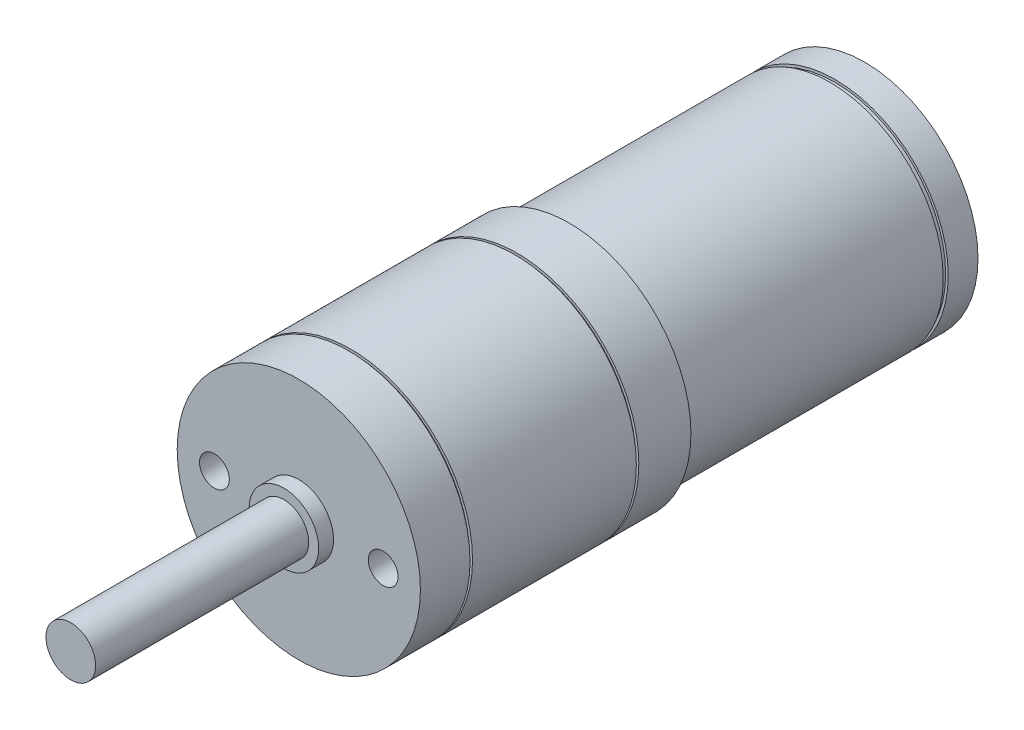
ISO-10303-21;
HEADER;
FILE_DESCRIPTION(('STEP AP214'),'2;1');
FILE_NAME('part.step','',(''),(''),'','','');
FILE_SCHEMA(('AUTOMOTIVE_DESIGN { 1 0 10303 214 1 1 1 1 }'));
ENDSEC;
DATA;
#1=APPLICATION_CONTEXT('core data for automotive mechanical design processes');
#2=APPLICATION_PROTOCOL_DEFINITION('international standard','automotive_design',2000,#1);
#3=PRODUCT_CONTEXT('',#1,'mechanical');
#4=PRODUCT('Part','Part','',(#3));
#5=PRODUCT_RELATED_PRODUCT_CATEGORY('part','',(#4));
#6=PRODUCT_DEFINITION_FORMATION('','',#4);
#7=PRODUCT_DEFINITION_CONTEXT('part definition',#1,'design');
#8=PRODUCT_DEFINITION('design','',#6,#7);
#9=PRODUCT_DEFINITION_SHAPE('','',#8);
#10=(LENGTH_UNIT() NAMED_UNIT(*) SI_UNIT(.MILLI.,.METRE.));
#11=(NAMED_UNIT(*) PLANE_ANGLE_UNIT() SI_UNIT($,.RADIAN.));
#12=(NAMED_UNIT(*) SI_UNIT($,.STERADIAN.) SOLID_ANGLE_UNIT());
#13=UNCERTAINTY_MEASURE_WITH_UNIT(LENGTH_MEASURE(1.E-05),#10,'distance_accuracy_value','');
#14=(GEOMETRIC_REPRESENTATION_CONTEXT(3) GLOBAL_UNCERTAINTY_ASSIGNED_CONTEXT((#13)) GLOBAL_UNIT_ASSIGNED_CONTEXT((#10,
#11,#12)) REPRESENTATION_CONTEXT('',''));
#15=CARTESIAN_POINT('',(0.,0.,0.));
#16=DIRECTION('',(0.,0.,1.));
#17=DIRECTION('',(1.,0.,0.));
#18=AXIS2_PLACEMENT_3D('',#15,#16,#17);
#19=CARTESIAN_POINT('',(0.,0.,-57.));
#20=DIRECTION('',(0.,0.,1.));
#21=DIRECTION('',(1.,0.,0.));
#22=AXIS2_PLACEMENT_3D('',#19,#20,#21);
#23=CYLINDRICAL_SURFACE('',#22,11.4144481492983);
#24=CARTESIAN_POINT('',(0.,0.,-27.75));
#25=DIRECTION('',(0.,0.,-1.));
#26=DIRECTION('',(-1.,0.,0.));
#27=AXIS2_PLACEMENT_3D('',#24,#25,#26);
#28=CIRCLE('',#27,11.4144481492983);
#29=CARTESIAN_POINT('',(-11.4144481492983,0.,-27.75));
#30=VERTEX_POINT('',#29);
#31=EDGE_CURVE('E177',#30,#30,#28,.T.);
#32=ORIENTED_EDGE('',*,*,#31,.T.);
#33=EDGE_LOOP('',(#32));
#34=FACE_BOUND('',#33,.T.);
#35=CARTESIAN_POINT('',(0.,0.,-53.5));
#36=DIRECTION('',(0.,0.,-1.));
#37=DIRECTION('',(-1.,0.,0.));
#38=AXIS2_PLACEMENT_3D('',#35,#36,#37);
#39=CIRCLE('',#38,11.4144481492983);
#40=CARTESIAN_POINT('',(-11.4144481492983,0.,-53.5));
#41=VERTEX_POINT('',#40);
#42=EDGE_CURVE('E196',#41,#41,#39,.T.);
#43=ORIENTED_EDGE('',*,*,#42,.F.);
#44=EDGE_LOOP('',(#43));
#45=FACE_BOUND('',#44,.T.);
#46=ADVANCED_FACE('F40',(#34,#45),#23,.T.);
#47=CARTESIAN_POINT('',(0.,0.,-27.75));
#48=DIRECTION('',(0.,0.,-1.));
#49=DIRECTION('',(-1.,0.,0.));
#50=AXIS2_PLACEMENT_3D('',#47,#48,#49);
#51=TOROIDAL_SURFACE('',#50,10.9144481492983,0.5);
#52=CARTESIAN_POINT('',(0.,0.,-27.25));
#53=DIRECTION('',(0.,0.,-1.));
#54=DIRECTION('',(-1.,0.,0.));
#55=AXIS2_PLACEMENT_3D('',#52,#53,#54);
#56=CIRCLE('',#55,10.9144481492983);
#57=CARTESIAN_POINT('',(-10.9144481492983,0.,-27.25));
#58=VERTEX_POINT('',#57);
#59=EDGE_CURVE('E49',#58,#58,#56,.F.);
#60=ORIENTED_EDGE('',*,*,#59,.F.);
#61=EDGE_LOOP('',(#60));
#62=FACE_BOUND('',#61,.T.);
#63=ORIENTED_EDGE('',*,*,#31,.F.);
#64=EDGE_LOOP('',(#63));
#65=FACE_BOUND('',#64,.T.);
#66=ADVANCED_FACE('F42',(#62,#65),#51,.T.);
#67=CARTESIAN_POINT('',(0.,0.,-61.8982322781408));
#68=DIRECTION('',(0.,0.,1.));
#69=DIRECTION('',(1.,0.,0.));
#70=AXIS2_PLACEMENT_3D('',#67,#68,#69);
#71=CYLINDRICAL_SURFACE('',#70,12.25);
#72=CARTESIAN_POINT('',(0.,0.,-27.25));
#73=DIRECTION('',(0.,0.,-1.));
#74=DIRECTION('',(-1.,0.,0.));
#75=AXIS2_PLACEMENT_3D('',#72,#73,#74);
#76=CIRCLE('',#75,12.25);
#77=CARTESIAN_POINT('',(-12.25,0.,-27.25));
#78=VERTEX_POINT('',#77);
#79=EDGE_CURVE('E258',#78,#78,#76,.T.);
#80=ORIENTED_EDGE('',*,*,#79,.F.);
#81=EDGE_LOOP('',(#80));
#82=FACE_BOUND('',#81,.T.);
#83=CARTESIAN_POINT('',(0.,0.,-22.));
#84=DIRECTION('',(0.,0.,1.));
#85=DIRECTION('',(1.,0.,0.));
#86=AXIS2_PLACEMENT_3D('',#83,#84,#85);
#87=CIRCLE('',#86,12.25);
#88=CARTESIAN_POINT('',(12.25,0.,-22.));
#89=VERTEX_POINT('',#88);
#90=EDGE_CURVE('E247',#89,#89,#87,.T.);
#91=ORIENTED_EDGE('',*,*,#90,.F.);
#92=EDGE_LOOP('',(#91));
#93=FACE_BOUND('',#92,.T.);
#94=ADVANCED_FACE('F187',(#82,#93),#71,.T.);
#95=CARTESIAN_POINT('',(0.,0.,-27.25));
#96=DIRECTION('',(0.,0.,-1.));
#97=DIRECTION('',(-1.,0.,0.));
#98=AXIS2_PLACEMENT_3D('',#95,#96,#97);
#99=PLANE('',#98);
#100=ORIENTED_EDGE('',*,*,#59,.T.);
#101=EDGE_LOOP('',(#100));
#102=FACE_BOUND('',#101,.T.);
#103=ORIENTED_EDGE('',*,*,#79,.T.);
#104=EDGE_LOOP('',(#103));
#105=FACE_BOUND('',#104,.T.);
#106=ADVANCED_FACE('F182',(#102,#105),#99,.T.);
#107=CARTESIAN_POINT('',(0.,0.,-27.));
#108=DIRECTION('',(0.,0.,1.));
#109=DIRECTION('',(1.,0.,0.));
#110=AXIS2_PLACEMENT_3D('',#107,#108,#109);
#111=CYLINDRICAL_SURFACE('',#110,12.25);
#112=CARTESIAN_POINT('',(0.,0.,-5.25));
#113=DIRECTION('',(0.,0.,1.));
#114=DIRECTION('',(1.,0.,0.));
#115=AXIS2_PLACEMENT_3D('',#112,#113,#114);
#116=CIRCLE('',#115,12.25);
#117=CARTESIAN_POINT('',(12.25,0.,-5.25));
#118=VERTEX_POINT('',#117);
#119=EDGE_CURVE('E202',#118,#118,#116,.T.);
#120=ORIENTED_EDGE('',*,*,#119,.F.);
#121=EDGE_LOOP('',(#120));
#122=FACE_BOUND('',#121,.T.);
#123=CARTESIAN_POINT('',(0.,0.,-21.75));
#124=DIRECTION('',(0.,0.,1.));
#125=DIRECTION('',(1.,0.,0.));
#126=AXIS2_PLACEMENT_3D('',#123,#124,#125);
#127=CIRCLE('',#126,12.25);
#128=CARTESIAN_POINT('',(12.25,0.,-21.75));
#129=VERTEX_POINT('',#128);
#130=EDGE_CURVE('E198',#129,#129,#127,.T.);
#131=ORIENTED_EDGE('',*,*,#130,.T.);
#132=EDGE_LOOP('',(#131));
#133=FACE_BOUND('',#132,.T.);
#134=ADVANCED_FACE('F346',(#122,#133),#111,.T.);
#135=CARTESIAN_POINT('',(0.,0.,-5.25));
#136=DIRECTION('',(0.,0.,1.));
#137=DIRECTION('',(1.,0.,0.));
#138=AXIS2_PLACEMENT_3D('',#135,#136,#137);
#139=PLANE('',#138);
#140=CARTESIAN_POINT('',(0.,0.,-5.25));
#141=DIRECTION('',(0.,0.,1.));
#142=DIRECTION('',(1.,0.,0.));
#143=AXIS2_PLACEMENT_3D('',#140,#141,#142);
#144=CIRCLE('',#143,11.9752077504731);
#145=CARTESIAN_POINT('',(11.9752077504731,0.,-5.25));
#146=VERTEX_POINT('',#145);
#147=EDGE_CURVE('E215',#146,#146,#144,.T.);
#148=ORIENTED_EDGE('',*,*,#147,.F.);
#149=EDGE_LOOP('',(#148));
#150=FACE_BOUND('',#149,.T.);
#151=ORIENTED_EDGE('',*,*,#119,.T.);
#152=EDGE_LOOP('',(#151));
#153=FACE_BOUND('',#152,.T.);
#154=ADVANCED_FACE('F383',(#150,#153),#139,.T.);
#155=CARTESIAN_POINT('',(0.,0.,-5.));
#156=DIRECTION('',(0.,0.,1.));
#157=DIRECTION('',(1.,0.,0.));
#158=AXIS2_PLACEMENT_3D('',#155,#156,#157);
#159=PLANE('',#158);
#160=CARTESIAN_POINT('',(0.,0.,-5.));
#161=DIRECTION('',(0.,0.,1.));
#162=DIRECTION('',(1.,0.,0.));
#163=AXIS2_PLACEMENT_3D('',#160,#161,#162);
#164=CIRCLE('',#163,11.9752077504731);
#165=CARTESIAN_POINT('',(11.9752077504731,0.,-5.));
#166=VERTEX_POINT('',#165);
#167=EDGE_CURVE('E242',#166,#166,#164,.T.);
#168=ORIENTED_EDGE('',*,*,#167,.T.);
#169=EDGE_LOOP('',(#168));
#170=FACE_BOUND('',#169,.T.);
#171=CARTESIAN_POINT('',(0.,0.,-5.));
#172=DIRECTION('',(0.,0.,1.));
#173=DIRECTION('',(1.,0.,0.));
#174=AXIS2_PLACEMENT_3D('',#171,#172,#173);
#175=CIRCLE('',#174,12.25);
#176=CARTESIAN_POINT('',(12.25,0.,-5.));
#177=VERTEX_POINT('',#176);
#178=EDGE_CURVE('E219',#177,#177,#175,.T.);
#179=ORIENTED_EDGE('',*,*,#178,.F.);
#180=EDGE_LOOP('',(#179));
#181=FACE_BOUND('',#180,.T.);
#182=ADVANCED_FACE('F381',(#170,#181),#159,.F.);
#183=CARTESIAN_POINT('',(0.,0.,-5.25));
#184=DIRECTION('',(0.,0.,1.));
#185=DIRECTION('',(1.,0.,0.));
#186=AXIS2_PLACEMENT_3D('',#183,#184,#185);
#187=CYLINDRICAL_SURFACE('',#186,11.9752077504731);
#188=ORIENTED_EDGE('',*,*,#147,.T.);
#189=EDGE_LOOP('',(#188));
#190=FACE_BOUND('',#189,.T.);
#191=ORIENTED_EDGE('',*,*,#167,.F.);
#192=EDGE_LOOP('',(#191));
#193=FACE_BOUND('',#192,.T.);
#194=ADVANCED_FACE('F377',(#190,#193),#187,.T.);
#195=CARTESIAN_POINT('',(0.,0.,9.4));
#196=DIRECTION('',(0.,0.,-1.));
#197=DIRECTION('',(-1.,0.,0.));
#198=AXIS2_PLACEMENT_3D('',#195,#196,#197);
#199=CYLINDRICAL_SURFACE('',#198,2.5);
#200=CARTESIAN_POINT('',(0.,0.,1.5));
#201=DIRECTION('',(0.,0.,1.));
#202=DIRECTION('',(1.,0.,0.));
#203=AXIS2_PLACEMENT_3D('',#200,#201,#202);
#204=CIRCLE('',#203,2.5);
#205=CARTESIAN_POINT('',(2.5,0.,1.5));
#206=VERTEX_POINT('',#205);
#207=EDGE_CURVE('E211',#206,#206,#204,.T.);
#208=ORIENTED_EDGE('',*,*,#207,.T.);
#209=EDGE_LOOP('',(#208));
#210=FACE_BOUND('',#209,.T.);
#211=CARTESIAN_POINT('',(0.,0.,22.969653899344));
#212=DIRECTION('',(0.,0.,1.));
#213=DIRECTION('',(1.,0.,0.));
#214=AXIS2_PLACEMENT_3D('',#211,#212,#213);
#215=CIRCLE('',#214,2.5);
#216=CARTESIAN_POINT('',(2.5,0.,22.969653899344));
#217=VERTEX_POINT('',#216);
#218=EDGE_CURVE('E440',#217,#217,#215,.T.);
#219=ORIENTED_EDGE('',*,*,#218,.F.);
#220=EDGE_LOOP('',(#219));
#221=FACE_BOUND('',#220,.T.);
#222=ADVANCED_FACE('F380',(#210,#221),#199,.T.);
#223=CARTESIAN_POINT('',(0.,0.,1.5));
#224=DIRECTION('',(0.,0.,1.));
#225=DIRECTION('',(1.,0.,0.));
#226=AXIS2_PLACEMENT_3D('',#223,#224,#225);
#227=PLANE('',#226);
#228=ORIENTED_EDGE('',*,*,#207,.F.);
#229=EDGE_LOOP('',(#228));
#230=FACE_BOUND('',#229,.T.);
#231=CARTESIAN_POINT('',(0.,0.,1.5));
#232=DIRECTION('',(0.,0.,1.));
#233=DIRECTION('',(1.,0.,0.));
#234=AXIS2_PLACEMENT_3D('',#231,#232,#233);
#235=CIRCLE('',#234,3.5);
#236=CARTESIAN_POINT('',(3.5,0.,1.5));
#237=VERTEX_POINT('',#236);
#238=EDGE_CURVE('E214',#237,#237,#235,.T.);
#239=ORIENTED_EDGE('',*,*,#238,.T.);
#240=EDGE_LOOP('',(#239));
#241=FACE_BOUND('',#240,.T.);
#242=ADVANCED_FACE('F404',(#230,#241),#227,.T.);
#243=CARTESIAN_POINT('',(8.5,0.,-6.));
#244=DIRECTION('',(0.,0.,1.));
#245=DIRECTION('',(1.,0.,0.));
#246=AXIS2_PLACEMENT_3D('',#243,#244,#245);
#247=PLANE('',#246);
#248=CARTESIAN_POINT('',(8.5,0.,-6.));
#249=DIRECTION('',(0.,0.,1.));
#250=DIRECTION('',(1.,0.,0.));
#251=AXIS2_PLACEMENT_3D('',#248,#249,#250);
#252=CIRCLE('',#251,1.5);
#253=CARTESIAN_POINT('',(10.,0.,-6.));
#254=VERTEX_POINT('',#253);
#255=EDGE_CURVE('E228',#254,#254,#252,.T.);
#256=ORIENTED_EDGE('',*,*,#255,.T.);
#257=EDGE_LOOP('',(#256));
#258=FACE_BOUND('',#257,.T.);
#259=ADVANCED_FACE('F394',(#258),#247,.T.);
#260=CARTESIAN_POINT('',(-8.5,0.,-6.));
#261=DIRECTION('',(0.,0.,1.));
#262=DIRECTION('',(1.,0.,0.));
#263=AXIS2_PLACEMENT_3D('',#260,#261,#262);
#264=PLANE('',#263);
#265=CARTESIAN_POINT('',(-8.5,0.,-6.));
#266=DIRECTION('',(0.,0.,1.));
#267=DIRECTION('',(1.,0.,0.));
#268=AXIS2_PLACEMENT_3D('',#265,#266,#267);
#269=CIRCLE('',#268,1.5);
#270=CARTESIAN_POINT('',(-7.,0.,-6.));
#271=VERTEX_POINT('',#270);
#272=EDGE_CURVE('E225',#271,#271,#269,.T.);
#273=ORIENTED_EDGE('',*,*,#272,.T.);
#274=EDGE_LOOP('',(#273));
#275=FACE_BOUND('',#274,.T.);
#276=ADVANCED_FACE('F390',(#275),#264,.T.);
#277=CARTESIAN_POINT('',(0.,0.,1.5));
#278=DIRECTION('',(0.,0.,-1.));
#279=DIRECTION('',(-1.,0.,0.));
#280=AXIS2_PLACEMENT_3D('',#277,#278,#279);
#281=CYLINDRICAL_SURFACE('',#280,3.5);
#282=ORIENTED_EDGE('',*,*,#238,.F.);
#283=EDGE_LOOP('',(#282));
#284=FACE_BOUND('',#283,.T.);
#285=CARTESIAN_POINT('',(0.,0.,0.));
#286=DIRECTION('',(0.,0.,1.));
#287=DIRECTION('',(1.,0.,0.));
#288=AXIS2_PLACEMENT_3D('',#285,#286,#287);
#289=CIRCLE('',#288,3.5);
#290=CARTESIAN_POINT('',(3.5,0.,0.));
#291=VERTEX_POINT('',#290);
#292=EDGE_CURVE('E221',#291,#291,#289,.T.);
#293=ORIENTED_EDGE('',*,*,#292,.T.);
#294=EDGE_LOOP('',(#293));
#295=FACE_BOUND('',#294,.T.);
#296=ADVANCED_FACE('F393',(#284,#295),#281,.T.);
#297=CARTESIAN_POINT('',(8.5,0.,-6.));
#298=DIRECTION('',(0.,0.,1.));
#299=DIRECTION('',(1.,0.,0.));
#300=AXIS2_PLACEMENT_3D('',#297,#298,#299);
#301=CYLINDRICAL_SURFACE('',#300,1.5);
#302=ORIENTED_EDGE('',*,*,#255,.F.);
#303=EDGE_LOOP('',(#302));
#304=FACE_BOUND('',#303,.T.);
#305=CARTESIAN_POINT('',(8.5,0.,0.));
#306=DIRECTION('',(0.,0.,1.));
#307=DIRECTION('',(1.,0.,0.));
#308=AXIS2_PLACEMENT_3D('',#305,#306,#307);
#309=CIRCLE('',#308,1.5);
#310=CARTESIAN_POINT('',(10.,0.,0.));
#311=VERTEX_POINT('',#310);
#312=EDGE_CURVE('E224',#311,#311,#309,.T.);
#313=ORIENTED_EDGE('',*,*,#312,.T.);
#314=EDGE_LOOP('',(#313));
#315=FACE_BOUND('',#314,.T.);
#316=ADVANCED_FACE('F400',(#304,#315),#301,.F.);
#317=CARTESIAN_POINT('',(-8.5,0.,-6.));
#318=DIRECTION('',(0.,0.,1.));
#319=DIRECTION('',(1.,0.,0.));
#320=AXIS2_PLACEMENT_3D('',#317,#318,#319);
#321=CYLINDRICAL_SURFACE('',#320,1.5);
#322=ORIENTED_EDGE('',*,*,#272,.F.);
#323=EDGE_LOOP('',(#322));
#324=FACE_BOUND('',#323,.T.);
#325=CARTESIAN_POINT('',(-8.5,0.,0.));
#326=DIRECTION('',(0.,0.,1.));
#327=DIRECTION('',(1.,0.,0.));
#328=AXIS2_PLACEMENT_3D('',#325,#326,#327);
#329=CIRCLE('',#328,1.5);
#330=CARTESIAN_POINT('',(-7.,0.,0.));
#331=VERTEX_POINT('',#330);
#332=EDGE_CURVE('E220',#331,#331,#329,.T.);
#333=ORIENTED_EDGE('',*,*,#332,.T.);
#334=EDGE_LOOP('',(#333));
#335=FACE_BOUND('',#334,.T.);
#336=ADVANCED_FACE('F396',(#324,#335),#321,.F.);
#337=CARTESIAN_POINT('',(0.,0.,0.));
#338=DIRECTION('',(0.,0.,1.));
#339=DIRECTION('',(1.,0.,0.));
#340=AXIS2_PLACEMENT_3D('',#337,#338,#339);
#341=PLANE('',#340);
#342=ORIENTED_EDGE('',*,*,#332,.F.);
#343=EDGE_LOOP('',(#342));
#344=FACE_BOUND('',#343,.T.);
#345=ORIENTED_EDGE('',*,*,#312,.F.);
#346=EDGE_LOOP('',(#345));
#347=FACE_BOUND('',#346,.T.);
#348=ORIENTED_EDGE('',*,*,#292,.F.);
#349=EDGE_LOOP('',(#348));
#350=FACE_BOUND('',#349,.T.);
#351=CARTESIAN_POINT('',(0.,0.,0.));
#352=DIRECTION('',(0.,0.,1.));
#353=DIRECTION('',(1.,0.,0.));
#354=AXIS2_PLACEMENT_3D('',#351,#352,#353);
#355=CIRCLE('',#354,12.25);
#356=CARTESIAN_POINT('',(12.25,0.,0.));
#357=VERTEX_POINT('',#356);
#358=EDGE_CURVE('E216',#357,#357,#355,.T.);
#359=ORIENTED_EDGE('',*,*,#358,.T.);
#360=EDGE_LOOP('',(#359));
#361=FACE_BOUND('',#360,.T.);
#362=ADVANCED_FACE('F399',(#344,#347,#350,#361),#341,.T.);
#363=ORIENTED_EDGE('',*,*,#178,.T.);
#364=EDGE_LOOP('',(#363));
#365=FACE_BOUND('',#364,.T.);
#366=ORIENTED_EDGE('',*,*,#358,.F.);
#367=EDGE_LOOP('',(#366));
#368=FACE_BOUND('',#367,.T.);
#369=ADVANCED_FACE('F372',(#365,#368),#111,.T.);
#370=CARTESIAN_POINT('',(0.,0.,-21.75));
#371=DIRECTION('',(0.,0.,-1.));
#372=DIRECTION('',(1.,0.,0.));
#373=AXIS2_PLACEMENT_3D('',#370,#371,#372);
#374=PLANE('',#373);
#375=ORIENTED_EDGE('',*,*,#130,.F.);
#376=EDGE_LOOP('',(#375));
#377=FACE_BOUND('',#376,.T.);
#378=CARTESIAN_POINT('',(0.,0.,-21.75));
#379=DIRECTION('',(0.,0.,1.));
#380=DIRECTION('',(1.,0.,0.));
#381=AXIS2_PLACEMENT_3D('',#378,#379,#380);
#382=CIRCLE('',#381,11.9752077504731);
#383=CARTESIAN_POINT('',(11.9752077504731,0.,-21.75));
#384=VERTEX_POINT('',#383);
#385=EDGE_CURVE('E239',#384,#384,#382,.T.);
#386=ORIENTED_EDGE('',*,*,#385,.T.);
#387=EDGE_LOOP('',(#386));
#388=FACE_BOUND('',#387,.T.);
#389=ADVANCED_FACE('F369',(#377,#388),#374,.T.);
#390=CARTESIAN_POINT('',(0.,0.,-22.));
#391=DIRECTION('',(0.,0.,-1.));
#392=DIRECTION('',(1.,0.,0.));
#393=AXIS2_PLACEMENT_3D('',#390,#391,#392);
#394=PLANE('',#393);
#395=ORIENTED_EDGE('',*,*,#90,.T.);
#396=EDGE_LOOP('',(#395));
#397=FACE_BOUND('',#396,.T.);
#398=CARTESIAN_POINT('',(0.,0.,-22.));
#399=DIRECTION('',(0.,0.,1.));
#400=DIRECTION('',(1.,0.,0.));
#401=AXIS2_PLACEMENT_3D('',#398,#399,#400);
#402=CIRCLE('',#401,11.9752077504731);
#403=CARTESIAN_POINT('',(11.9752077504731,0.,-22.));
#404=VERTEX_POINT('',#403);
#405=EDGE_CURVE('E249',#404,#404,#402,.T.);
#406=ORIENTED_EDGE('',*,*,#405,.F.);
#407=EDGE_LOOP('',(#406));
#408=FACE_BOUND('',#407,.T.);
#409=ADVANCED_FACE('F367',(#397,#408),#394,.F.);
#410=CARTESIAN_POINT('',(0.,0.,-21.75));
#411=DIRECTION('',(0.,0.,-1.));
#412=DIRECTION('',(-1.,0.,0.));
#413=AXIS2_PLACEMENT_3D('',#410,#411,#412);
#414=CYLINDRICAL_SURFACE('',#413,11.9752077504731);
#415=ORIENTED_EDGE('',*,*,#385,.F.);
#416=EDGE_LOOP('',(#415));
#417=FACE_BOUND('',#416,.T.);
#418=ORIENTED_EDGE('',*,*,#405,.T.);
#419=EDGE_LOOP('',(#418));
#420=FACE_BOUND('',#419,.T.);
#421=ADVANCED_FACE('F363',(#417,#420),#414,.T.);
#422=CARTESIAN_POINT('',(0.,0.,-53.5));
#423=DIRECTION('',(0.,0.,-1.));
#424=DIRECTION('',(-1.,0.,0.));
#425=AXIS2_PLACEMENT_3D('',#422,#423,#424);
#426=PLANE('',#425);
#427=CARTESIAN_POINT('',(0.,0.,-53.5));
#428=DIRECTION('',(0.,0.,-1.));
#429=DIRECTION('',(-1.,0.,0.));
#430=AXIS2_PLACEMENT_3D('',#427,#428,#429);
#431=CIRCLE('',#430,11.1544273579982);
#432=CARTESIAN_POINT('',(-11.1544273579982,0.,-53.5));
#433=VERTEX_POINT('',#432);
#434=EDGE_CURVE('E205',#433,#433,#431,.T.);
#435=ORIENTED_EDGE('',*,*,#434,.F.);
#436=EDGE_LOOP('',(#435));
#437=FACE_BOUND('',#436,.T.);
#438=ORIENTED_EDGE('',*,*,#42,.T.);
#439=EDGE_LOOP('',(#438));
#440=FACE_BOUND('',#439,.T.);
#441=ADVANCED_FACE('F366',(#437,#440),#426,.T.);
#442=CARTESIAN_POINT('',(0.,0.,-54.));
#443=DIRECTION('',(0.,0.,-1.));
#444=DIRECTION('',(-1.,0.,0.));
#445=AXIS2_PLACEMENT_3D('',#442,#443,#444);
#446=PLANE('',#445);
#447=CARTESIAN_POINT('',(0.,0.,-54.));
#448=DIRECTION('',(0.,0.,-1.));
#449=DIRECTION('',(-1.,0.,0.));
#450=AXIS2_PLACEMENT_3D('',#447,#448,#449);
#451=CIRCLE('',#450,11.1544273579982);
#452=CARTESIAN_POINT('',(-11.1544273579982,0.,-54.));
#453=VERTEX_POINT('',#452);
#454=EDGE_CURVE('E208',#453,#453,#451,.T.);
#455=ORIENTED_EDGE('',*,*,#454,.T.);
#456=EDGE_LOOP('',(#455));
#457=FACE_BOUND('',#456,.T.);
#458=CARTESIAN_POINT('',(0.,0.,-54.));
#459=DIRECTION('',(0.,0.,-1.));
#460=DIRECTION('',(-1.,0.,0.));
#461=AXIS2_PLACEMENT_3D('',#458,#459,#460);
#462=CIRCLE('',#461,11.4144481492983);
#463=CARTESIAN_POINT('',(-11.4144481492983,0.,-54.));
#464=VERTEX_POINT('',#463);
#465=EDGE_CURVE('E199',#464,#464,#462,.T.);
#466=ORIENTED_EDGE('',*,*,#465,.F.);
#467=EDGE_LOOP('',(#466));
#468=FACE_BOUND('',#467,.T.);
#469=ADVANCED_FACE('F424',(#457,#468),#446,.F.);
#470=CARTESIAN_POINT('',(0.,0.,-53.5));
#471=DIRECTION('',(0.,0.,-1.));
#472=DIRECTION('',(-1.,0.,0.));
#473=AXIS2_PLACEMENT_3D('',#470,#471,#472);
#474=CYLINDRICAL_SURFACE('',#473,11.1544273579982);
#475=ORIENTED_EDGE('',*,*,#434,.T.);
#476=EDGE_LOOP('',(#475));
#477=FACE_BOUND('',#476,.T.);
#478=ORIENTED_EDGE('',*,*,#454,.F.);
#479=EDGE_LOOP('',(#478));
#480=FACE_BOUND('',#479,.T.);
#481=ADVANCED_FACE('F336',(#477,#480),#474,.T.);
#482=CARTESIAN_POINT('',(1.,6.,-59.668792543122));
#483=DIRECTION('',(-1.,0.,0.));
#484=DIRECTION('',(0.,0.,1.));
#485=AXIS2_PLACEMENT_3D('',#482,#483,#484);
#486=CYLINDRICAL_SURFACE('',#485,0.499999999999999);
#487=CARTESIAN_POINT('',(1.,6.,-59.668792543122));
#488=DIRECTION('',(-1.,0.,0.));
#489=DIRECTION('',(0.,0.,1.));
#490=AXIS2_PLACEMENT_3D('',#487,#488,#489);
#491=CIRCLE('',#490,0.499999999999999);
#492=CARTESIAN_POINT('',(1.,6.,-59.168792543122));
#493=VERTEX_POINT('',#492);
#494=EDGE_CURVE('E271',#493,#493,#491,.T.);
#495=ORIENTED_EDGE('',*,*,#494,.F.);
#496=EDGE_LOOP('',(#495));
#497=FACE_BOUND('',#496,.T.);
#498=CARTESIAN_POINT('',(-1.,6.,-59.668792543122));
#499=DIRECTION('',(-1.,0.,0.));
#500=DIRECTION('',(0.,0.,1.));
#501=AXIS2_PLACEMENT_3D('',#498,#499,#500);
#502=CIRCLE('',#501,0.499999999999999);
#503=CARTESIAN_POINT('',(-1.,6.,-59.168792543122));
#504=VERTEX_POINT('',#503);
#505=EDGE_CURVE('E264',#504,#504,#502,.T.);
#506=ORIENTED_EDGE('',*,*,#505,.T.);
#507=EDGE_LOOP('',(#506));
#508=FACE_BOUND('',#507,.T.);
#509=ADVANCED_FACE('F322',(#497,#508),#486,.F.);
#510=CARTESIAN_POINT('',(1.,6.,-59.668792543122));
#511=DIRECTION('',(-1.,0.,0.));
#512=DIRECTION('',(0.,0.,1.));
#513=AXIS2_PLACEMENT_3D('',#510,#511,#512);
#514=CYLINDRICAL_SURFACE('',#513,1.13139474229126);
#515=CARTESIAN_POINT('',(-1.,6.,-59.668792543122));
#516=DIRECTION('',(1.,0.,0.));
#517=DIRECTION('',(0.,0.,1.));
#518=AXIS2_PLACEMENT_3D('',#515,#516,#517);
#519=CIRCLE('',#518,1.13139474229126);
#520=CARTESIAN_POINT('',(-1.,4.86860525770874,-59.668792543122));
#521=VERTEX_POINT('',#520);
#522=CARTESIAN_POINT('',(-1.,7.13139474229126,-59.668792543122));
#523=VERTEX_POINT('',#522);
#524=EDGE_CURVE('E126',#521,#523,#519,.T.);
#525=ORIENTED_EDGE('',*,*,#524,.T.);
#526=DIRECTION('',(-1.,0.,0.));
#527=VECTOR('',#526,1.);
#528=CARTESIAN_POINT('',(1.,7.13139474229126,-59.668792543122));
#529=LINE('',#528,#527);
#530=CARTESIAN_POINT('',(1.,7.13139474229126,-59.668792543122));
#531=VERTEX_POINT('',#530);
#532=EDGE_CURVE('E109',#531,#523,#529,.T.);
#533=ORIENTED_EDGE('',*,*,#532,.F.);
#534=CARTESIAN_POINT('',(1.,6.,-59.668792543122));
#535=DIRECTION('',(1.,0.,0.));
#536=DIRECTION('',(0.,0.,1.));
#537=AXIS2_PLACEMENT_3D('',#534,#535,#536);
#538=CIRCLE('',#537,1.13139474229126);
#539=CARTESIAN_POINT('',(1.,4.86860525770874,-59.668792543122));
#540=VERTEX_POINT('',#539);
#541=EDGE_CURVE('E114',#540,#531,#538,.T.);
#542=ORIENTED_EDGE('',*,*,#541,.F.);
#543=DIRECTION('',(-1.,0.,0.));
#544=VECTOR('',#543,1.);
#545=CARTESIAN_POINT('',(1.,4.86860525770874,-59.668792543122));
#546=LINE('',#545,#544);
#547=EDGE_CURVE('E128',#540,#521,#546,.T.);
#548=ORIENTED_EDGE('',*,*,#547,.T.);
#549=EDGE_LOOP('',(#525,#533,#542,#548));
#550=FACE_BOUND('',#549,.T.);
#551=ADVANCED_FACE('F124',(#550),#514,.T.);
#552=CARTESIAN_POINT('',(1.,-6.,-59.668792543122));
#553=DIRECTION('',(-1.,0.,0.));
#554=DIRECTION('',(0.,0.,1.));
#555=AXIS2_PLACEMENT_3D('',#552,#553,#554);
#556=CYLINDRICAL_SURFACE('',#555,1.13139474229126);
#557=CARTESIAN_POINT('',(-1.,-6.,-59.668792543122));
#558=DIRECTION('',(1.,0.,0.));
#559=DIRECTION('',(0.,0.,-1.));
#560=AXIS2_PLACEMENT_3D('',#557,#558,#559);
#561=CIRCLE('',#560,1.13139474229126);
#562=CARTESIAN_POINT('',(-1.,-7.13139474229126,-59.668792543122));
#563=VERTEX_POINT('',#562);
#564=CARTESIAN_POINT('',(-1.,-4.86860525770873,-59.668792543122));
#565=VERTEX_POINT('',#564);
#566=EDGE_CURVE('E127',#563,#565,#561,.T.);
#567=ORIENTED_EDGE('',*,*,#566,.T.);
#568=DIRECTION('',(-1.,0.,0.));
#569=VECTOR('',#568,1.);
#570=CARTESIAN_POINT('',(1.,-4.86860525770873,-59.668792543122));
#571=LINE('',#570,#569);
#572=CARTESIAN_POINT('',(1.,-4.86860525770873,-59.668792543122));
#573=VERTEX_POINT('',#572);
#574=EDGE_CURVE('E151',#573,#565,#571,.T.);
#575=ORIENTED_EDGE('',*,*,#574,.F.);
#576=CARTESIAN_POINT('',(1.,-6.,-59.668792543122));
#577=DIRECTION('',(1.,0.,0.));
#578=DIRECTION('',(0.,0.,-1.));
#579=AXIS2_PLACEMENT_3D('',#576,#577,#578);
#580=CIRCLE('',#579,1.13139474229126);
#581=CARTESIAN_POINT('',(1.,-7.13139474229126,-59.668792543122));
#582=VERTEX_POINT('',#581);
#583=EDGE_CURVE('E136',#582,#573,#580,.T.);
#584=ORIENTED_EDGE('',*,*,#583,.F.);
#585=DIRECTION('',(-1.,0.,0.));
#586=VECTOR('',#585,1.);
#587=CARTESIAN_POINT('',(1.,-7.13139474229126,-59.668792543122));
#588=LINE('',#587,#586);
#589=EDGE_CURVE('E144',#582,#563,#588,.T.);
#590=ORIENTED_EDGE('',*,*,#589,.T.);
#591=EDGE_LOOP('',(#567,#575,#584,#590));
#592=FACE_BOUND('',#591,.T.);
#593=ADVANCED_FACE('F300',(#592),#556,.T.);
#594=CARTESIAN_POINT('',(1.,-6.,-59.668792543122));
#595=DIRECTION('',(-1.,0.,0.));
#596=DIRECTION('',(0.,0.,1.));
#597=AXIS2_PLACEMENT_3D('',#594,#595,#596);
#598=CYLINDRICAL_SURFACE('',#597,0.499999999999999);
#599=CARTESIAN_POINT('',(1.,-6.,-59.668792543122));
#600=DIRECTION('',(-1.,0.,0.));
#601=DIRECTION('',(0.,0.,1.));
#602=AXIS2_PLACEMENT_3D('',#599,#600,#601);
#603=CIRCLE('',#602,0.499999999999999);
#604=CARTESIAN_POINT('',(1.,-6.,-59.168792543122));
#605=VERTEX_POINT('',#604);
#606=EDGE_CURVE('E265',#605,#605,#603,.T.);
#607=ORIENTED_EDGE('',*,*,#606,.F.);
#608=EDGE_LOOP('',(#607));
#609=FACE_BOUND('',#608,.T.);
#610=CARTESIAN_POINT('',(-1.,-6.,-59.668792543122));
#611=DIRECTION('',(-1.,0.,0.));
#612=DIRECTION('',(0.,0.,1.));
#613=AXIS2_PLACEMENT_3D('',#610,#611,#612);
#614=CIRCLE('',#613,0.499999999999999);
#615=CARTESIAN_POINT('',(-1.,-6.,-59.168792543122));
#616=VERTEX_POINT('',#615);
#617=EDGE_CURVE('E268',#616,#616,#614,.T.);
#618=ORIENTED_EDGE('',*,*,#617,.T.);
#619=EDGE_LOOP('',(#618));
#620=FACE_BOUND('',#619,.T.);
#621=ADVANCED_FACE('F303',(#609,#620),#598,.F.);
#622=CARTESIAN_POINT('',(0.,0.,-58.));
#623=DIRECTION('',(0.,0.,-1.));
#624=DIRECTION('',(-1.,0.,0.));
#625=AXIS2_PLACEMENT_3D('',#622,#623,#624);
#626=PLANE('',#625);
#627=CARTESIAN_POINT('',(0.,0.,-58.));
#628=DIRECTION('',(0.,0.,-1.));
#629=DIRECTION('',(-1.,0.,0.));
#630=AXIS2_PLACEMENT_3D('',#627,#628,#629);
#631=CIRCLE('',#630,2.16140638380562);
#632=CARTESIAN_POINT('',(-2.16140638380562,0.,-58.));
#633=VERTEX_POINT('',#632);
#634=EDGE_CURVE('E174',#633,#633,#631,.T.);
#635=ORIENTED_EDGE('',*,*,#634,.T.);
#636=EDGE_LOOP('',(#635));
#637=FACE_BOUND('',#636,.T.);
#638=ADVANCED_FACE('F329',(#637),#626,.T.);
#639=CARTESIAN_POINT('',(-1.,6.,-59.668792543122));
#640=DIRECTION('',(-1.,0.,0.));
#641=DIRECTION('',(0.,0.,1.));
#642=AXIS2_PLACEMENT_3D('',#639,#640,#641);
#643=PLANE('',#642);
#644=ORIENTED_EDGE('',*,*,#505,.F.);
#645=EDGE_LOOP('',(#644));
#646=FACE_BOUND('',#645,.T.);
#647=DIRECTION('',(0.,0.,-1.));
#648=VECTOR('',#647,1.);
#649=CARTESIAN_POINT('',(-1.,4.86860525770874,-59.668792543122));
#650=LINE('',#649,#648);
#651=CARTESIAN_POINT('',(-1.,4.86860525770873,-57.));
#652=VERTEX_POINT('',#651);
#653=EDGE_CURVE('E122',#652,#521,#650,.T.);
#654=ORIENTED_EDGE('',*,*,#653,.F.);
#655=DIRECTION('',(0.,1.,0.));
#656=VECTOR('',#655,1.);
#657=CARTESIAN_POINT('',(-1.,0.,-57.));
#658=LINE('',#657,#656);
#659=CARTESIAN_POINT('',(-1.,7.13139474229126,-57.));
#660=VERTEX_POINT('',#659);
#661=EDGE_CURVE('E168',#652,#660,#658,.T.);
#662=ORIENTED_EDGE('',*,*,#661,.T.);
#663=DIRECTION('',(0.,0.,1.));
#664=VECTOR('',#663,1.);
#665=CARTESIAN_POINT('',(-1.,7.13139474229126,-59.668792543122));
#666=LINE('',#665,#664);
#667=EDGE_CURVE('E278',#523,#660,#666,.T.);
#668=ORIENTED_EDGE('',*,*,#667,.F.);
#669=ORIENTED_EDGE('',*,*,#524,.F.);
#670=EDGE_LOOP('',(#654,#662,#668,#669));
#671=FACE_BOUND('',#670,.T.);
#672=ADVANCED_FACE('F283',(#646,#671),#643,.T.);
#673=CARTESIAN_POINT('',(1.,7.13139474229126,-59.668792543122));
#674=DIRECTION('',(0.,-1.,0.));
#675=DIRECTION('',(0.,0.,-1.));
#676=AXIS2_PLACEMENT_3D('',#673,#674,#675);
#677=PLANE('',#676);
#678=DIRECTION('',(-1.,0.,0.));
#679=VECTOR('',#678,1.);
#680=CARTESIAN_POINT('',(0.,7.13139474229126,-57.));
#681=LINE('',#680,#679);
#682=CARTESIAN_POINT('',(1.,7.13139474229126,-57.));
#683=VERTEX_POINT('',#682);
#684=EDGE_CURVE('E111',#683,#660,#681,.T.);
#685=ORIENTED_EDGE('',*,*,#684,.F.);
#686=DIRECTION('',(0.,0.,1.));
#687=VECTOR('',#686,1.);
#688=CARTESIAN_POINT('',(1.,7.13139474229126,-59.668792543122));
#689=LINE('',#688,#687);
#690=EDGE_CURVE('E104',#531,#683,#689,.T.);
#691=ORIENTED_EDGE('',*,*,#690,.F.);
#692=ORIENTED_EDGE('',*,*,#532,.T.);
#693=ORIENTED_EDGE('',*,*,#667,.T.);
#694=EDGE_LOOP('',(#685,#691,#692,#693));
#695=FACE_BOUND('',#694,.T.);
#696=ADVANCED_FACE('F106',(#695),#677,.F.);
#697=CARTESIAN_POINT('',(1.,6.,-59.668792543122));
#698=DIRECTION('',(-1.,0.,0.));
#699=DIRECTION('',(0.,0.,1.));
#700=AXIS2_PLACEMENT_3D('',#697,#698,#699);
#701=PLANE('',#700);
#702=ORIENTED_EDGE('',*,*,#494,.T.);
#703=EDGE_LOOP('',(#702));
#704=FACE_BOUND('',#703,.T.);
#705=DIRECTION('',(0.,1.,0.));
#706=VECTOR('',#705,1.);
#707=CARTESIAN_POINT('',(1.,0.,-57.));
#708=LINE('',#707,#706);
#709=CARTESIAN_POINT('',(1.,4.86860525770874,-57.));
#710=VERTEX_POINT('',#709);
#711=EDGE_CURVE('E56',#710,#683,#708,.T.);
#712=ORIENTED_EDGE('',*,*,#711,.F.);
#713=DIRECTION('',(0.,0.,-1.));
#714=VECTOR('',#713,1.);
#715=CARTESIAN_POINT('',(1.,4.86860525770874,-59.668792543122));
#716=LINE('',#715,#714);
#717=EDGE_CURVE('E113',#710,#540,#716,.T.);
#718=ORIENTED_EDGE('',*,*,#717,.T.);
#719=ORIENTED_EDGE('',*,*,#541,.T.);
#720=ORIENTED_EDGE('',*,*,#690,.T.);
#721=EDGE_LOOP('',(#712,#718,#719,#720));
#722=FACE_BOUND('',#721,.T.);
#723=ADVANCED_FACE('F117',(#704,#722),#701,.F.);
#724=CARTESIAN_POINT('',(1.,4.86860525770874,-59.668792543122));
#725=DIRECTION('',(0.,1.,0.));
#726=DIRECTION('',(0.,0.,1.));
#727=AXIS2_PLACEMENT_3D('',#724,#725,#726);
#728=PLANE('',#727);
#729=DIRECTION('',(1.,0.,0.));
#730=VECTOR('',#729,1.);
#731=CARTESIAN_POINT('',(0.,4.86860525770874,-57.));
#732=LINE('',#731,#730);
#733=EDGE_CURVE('E61',#652,#710,#732,.T.);
#734=ORIENTED_EDGE('',*,*,#733,.F.);
#735=ORIENTED_EDGE('',*,*,#653,.T.);
#736=ORIENTED_EDGE('',*,*,#547,.F.);
#737=ORIENTED_EDGE('',*,*,#717,.F.);
#738=EDGE_LOOP('',(#734,#735,#736,#737));
#739=FACE_BOUND('',#738,.T.);
#740=ADVANCED_FACE('F281',(#739),#728,.F.);
#741=CARTESIAN_POINT('',(1.,-7.13139474229126,-59.668792543122));
#742=DIRECTION('',(0.,1.,0.));
#743=DIRECTION('',(0.,0.,1.));
#744=AXIS2_PLACEMENT_3D('',#741,#742,#743);
#745=PLANE('',#744);
#746=DIRECTION('',(1.,0.,0.));
#747=VECTOR('',#746,1.);
#748=CARTESIAN_POINT('',(0.,-7.13139474229126,-57.));
#749=LINE('',#748,#747);
#750=CARTESIAN_POINT('',(-1.,-7.13139474229126,-57.));
#751=VERTEX_POINT('',#750);
#752=CARTESIAN_POINT('',(1.,-7.13139474229126,-57.));
#753=VERTEX_POINT('',#752);
#754=EDGE_CURVE('E160',#751,#753,#749,.T.);
#755=ORIENTED_EDGE('',*,*,#754,.F.);
#756=DIRECTION('',(0.,0.,-1.));
#757=VECTOR('',#756,1.);
#758=CARTESIAN_POINT('',(-1.,-7.13139474229126,-59.668792543122));
#759=LINE('',#758,#757);
#760=EDGE_CURVE('E140',#751,#563,#759,.T.);
#761=ORIENTED_EDGE('',*,*,#760,.T.);
#762=ORIENTED_EDGE('',*,*,#589,.F.);
#763=DIRECTION('',(0.,0.,-1.));
#764=VECTOR('',#763,1.);
#765=CARTESIAN_POINT('',(1.,-7.13139474229126,-59.668792543122));
#766=LINE('',#765,#764);
#767=EDGE_CURVE('E143',#753,#582,#766,.T.);
#768=ORIENTED_EDGE('',*,*,#767,.F.);
#769=EDGE_LOOP('',(#755,#761,#762,#768));
#770=FACE_BOUND('',#769,.T.);
#771=ADVANCED_FACE('F310',(#770),#745,.F.);
#772=CARTESIAN_POINT('',(-1.,-6.,-59.668792543122));
#773=DIRECTION('',(1.,0.,0.));
#774=DIRECTION('',(0.,0.,-1.));
#775=AXIS2_PLACEMENT_3D('',#772,#773,#774);
#776=PLANE('',#775);
#777=ORIENTED_EDGE('',*,*,#617,.F.);
#778=EDGE_LOOP('',(#777));
#779=FACE_BOUND('',#778,.T.);
#780=DIRECTION('',(0.,-1.,0.));
#781=VECTOR('',#780,1.);
#782=CARTESIAN_POINT('',(-1.,0.,-57.));
#783=LINE('',#782,#781);
#784=CARTESIAN_POINT('',(-1.,-4.86860525770874,-57.));
#785=VERTEX_POINT('',#784);
#786=EDGE_CURVE('E157',#785,#751,#783,.T.);
#787=ORIENTED_EDGE('',*,*,#786,.F.);
#788=DIRECTION('',(0.,0.,1.));
#789=VECTOR('',#788,1.);
#790=CARTESIAN_POINT('',(-1.,-4.86860525770873,-59.668792543122));
#791=LINE('',#790,#789);
#792=EDGE_CURVE('E131',#565,#785,#791,.T.);
#793=ORIENTED_EDGE('',*,*,#792,.F.);
#794=ORIENTED_EDGE('',*,*,#566,.F.);
#795=ORIENTED_EDGE('',*,*,#760,.F.);
#796=EDGE_LOOP('',(#787,#793,#794,#795));
#797=FACE_BOUND('',#796,.T.);
#798=ADVANCED_FACE('F308',(#779,#797),#776,.F.);
#799=CARTESIAN_POINT('',(1.,-4.86860525770873,-59.668792543122));
#800=DIRECTION('',(0.,-1.,0.));
#801=DIRECTION('',(0.,0.,-1.));
#802=AXIS2_PLACEMENT_3D('',#799,#800,#801);
#803=PLANE('',#802);
#804=DIRECTION('',(-1.,0.,0.));
#805=VECTOR('',#804,1.);
#806=CARTESIAN_POINT('',(0.,-4.86860525770874,-57.));
#807=LINE('',#806,#805);
#808=CARTESIAN_POINT('',(1.,-4.86860525770874,-57.));
#809=VERTEX_POINT('',#808);
#810=EDGE_CURVE('E163',#809,#785,#807,.T.);
#811=ORIENTED_EDGE('',*,*,#810,.F.);
#812=DIRECTION('',(0.,0.,1.));
#813=VECTOR('',#812,1.);
#814=CARTESIAN_POINT('',(1.,-4.86860525770873,-59.668792543122));
#815=LINE('',#814,#813);
#816=EDGE_CURVE('E139',#573,#809,#815,.T.);
#817=ORIENTED_EDGE('',*,*,#816,.F.);
#818=ORIENTED_EDGE('',*,*,#574,.T.);
#819=ORIENTED_EDGE('',*,*,#792,.T.);
#820=EDGE_LOOP('',(#811,#817,#818,#819));
#821=FACE_BOUND('',#820,.T.);
#822=ADVANCED_FACE('F305',(#821),#803,.F.);
#823=CARTESIAN_POINT('',(1.,-6.,-59.668792543122));
#824=DIRECTION('',(1.,0.,0.));
#825=DIRECTION('',(0.,0.,-1.));
#826=AXIS2_PLACEMENT_3D('',#823,#824,#825);
#827=PLANE('',#826);
#828=ORIENTED_EDGE('',*,*,#606,.T.);
#829=EDGE_LOOP('',(#828));
#830=FACE_BOUND('',#829,.T.);
#831=ORIENTED_EDGE('',*,*,#816,.T.);
#832=DIRECTION('',(0.,-1.,0.));
#833=VECTOR('',#832,1.);
#834=CARTESIAN_POINT('',(1.,0.,-57.));
#835=LINE('',#834,#833);
#836=EDGE_CURVE('E166',#809,#753,#835,.T.);
#837=ORIENTED_EDGE('',*,*,#836,.T.);
#838=ORIENTED_EDGE('',*,*,#767,.T.);
#839=ORIENTED_EDGE('',*,*,#583,.T.);
#840=EDGE_LOOP('',(#831,#837,#838,#839));
#841=FACE_BOUND('',#840,.T.);
#842=ADVANCED_FACE('F295',(#830,#841),#827,.T.);
#843=CARTESIAN_POINT('',(0.,0.,-57.));
#844=DIRECTION('',(0.,0.,-1.));
#845=DIRECTION('',(-1.,0.,0.));
#846=AXIS2_PLACEMENT_3D('',#843,#844,#845);
#847=TOROIDAL_SURFACE('',#846,2.16140638380562,1.);
#848=CARTESIAN_POINT('',(0.,0.,-57.));
#849=DIRECTION('',(0.,0.,-1.));
#850=DIRECTION('',(-1.,0.,0.));
#851=AXIS2_PLACEMENT_3D('',#848,#849,#850);
#852=CIRCLE('',#851,3.16140638380562);
#853=CARTESIAN_POINT('',(-3.16140638380562,0.,-57.));
#854=VERTEX_POINT('',#853);
#855=EDGE_CURVE('E261',#854,#854,#852,.T.);
#856=ORIENTED_EDGE('',*,*,#855,.T.);
#857=EDGE_LOOP('',(#856));
#858=FACE_BOUND('',#857,.T.);
#859=ORIENTED_EDGE('',*,*,#634,.F.);
#860=EDGE_LOOP('',(#859));
#861=FACE_BOUND('',#860,.T.);
#862=ADVANCED_FACE('F286',(#858,#861),#847,.T.);
#863=CARTESIAN_POINT('',(0.,0.,-57.));
#864=DIRECTION('',(0.,0.,-1.));
#865=DIRECTION('',(-1.,0.,0.));
#866=AXIS2_PLACEMENT_3D('',#863,#864,#865);
#867=PLANE('',#866);
#868=ORIENTED_EDGE('',*,*,#855,.F.);
#869=EDGE_LOOP('',(#868));
#870=FACE_BOUND('',#869,.T.);
#871=ORIENTED_EDGE('',*,*,#836,.F.);
#872=ORIENTED_EDGE('',*,*,#810,.T.);
#873=ORIENTED_EDGE('',*,*,#786,.T.);
#874=ORIENTED_EDGE('',*,*,#754,.T.);
#875=EDGE_LOOP('',(#871,#872,#873,#874));
#876=FACE_BOUND('',#875,.T.);
#877=CARTESIAN_POINT('',(0.,0.,-57.));
#878=DIRECTION('',(0.,0.,-1.));
#879=DIRECTION('',(-1.,0.,0.));
#880=AXIS2_PLACEMENT_3D('',#877,#878,#879);
#881=CIRCLE('',#880,11.4144481492983);
#882=CARTESIAN_POINT('',(-11.4144481492983,0.,-57.));
#883=VERTEX_POINT('',#882);
#884=EDGE_CURVE('E154',#883,#883,#881,.T.);
#885=ORIENTED_EDGE('',*,*,#884,.T.);
#886=EDGE_LOOP('',(#885));
#887=FACE_BOUND('',#886,.T.);
#888=ORIENTED_EDGE('',*,*,#733,.T.);
#889=ORIENTED_EDGE('',*,*,#711,.T.);
#890=ORIENTED_EDGE('',*,*,#684,.T.);
#891=ORIENTED_EDGE('',*,*,#661,.F.);
#892=EDGE_LOOP('',(#888,#889,#890,#891));
#893=FACE_BOUND('',#892,.T.);
#894=ADVANCED_FACE('F284',(#870,#876,#887,#893),#867,.T.);
#895=ORIENTED_EDGE('',*,*,#465,.T.);
#896=EDGE_LOOP('',(#895));
#897=FACE_BOUND('',#896,.T.);
#898=ORIENTED_EDGE('',*,*,#884,.F.);
#899=EDGE_LOOP('',(#898));
#900=FACE_BOUND('',#899,.T.);
#901=ADVANCED_FACE('F193',(#897,#900),#23,.T.);
#902=CARTESIAN_POINT('',(0.,0.,22.969653899344));
#903=DIRECTION('',(0.,0.,1.));
#904=DIRECTION('',(1.,0.,0.));
#905=AXIS2_PLACEMENT_3D('',#902,#903,#904);
#906=PLANE('',#905);
#907=ORIENTED_EDGE('',*,*,#218,.T.);
#908=EDGE_LOOP('',(#907));
#909=FACE_BOUND('',#908,.T.);
#910=ADVANCED_FACE('F293',(#909),#906,.T.);
#911=CLOSED_SHELL('',(#46,#66,#94,#106,#134,#154,#182,#194,#222,#242,#259,#276,#296,#316,#336,
#362,#369,#389,#409,#421,#441,#469,#481,#509,#551,#593,#621,#638,#672,#696,#723,#740,#771,#798,
#822,#842,#862,#894,#901,#910));
#912=CARTESIAN_POINT('',(0.,0.,-26.75));
#913=DIRECTION('',(0.,0.,-1.));
#914=DIRECTION('',(-1.,0.,0.));
#915=AXIS2_PLACEMENT_3D('',#912,#913,#914);
#916=PLANE('',#915);
#917=CARTESIAN_POINT('',(0.,0.,-26.75));
#918=DIRECTION('',(0.,0.,-1.));
#919=DIRECTION('',(-1.,0.,0.));
#920=AXIS2_PLACEMENT_3D('',#917,#918,#919);
#921=CIRCLE('',#920,11.4144481492983);
#922=CARTESIAN_POINT('',(-11.4144481492983,0.,-26.75));
#923=VERTEX_POINT('',#922);
#924=EDGE_CURVE('E253',#923,#923,#921,.T.);
#925=ORIENTED_EDGE('',*,*,#924,.T.);
#926=EDGE_LOOP('',(#925));
#927=FACE_BOUND('',#926,.T.);
#928=ADVANCED_FACE('F356',(#927),#916,.T.);
#929=CARTESIAN_POINT('',(0.,0.,-26.75));
#930=DIRECTION('',(0.,0.,-1.));
#931=DIRECTION('',(-1.,0.,0.));
#932=AXIS2_PLACEMENT_3D('',#929,#930,#931);
#933=CYLINDRICAL_SURFACE('',#932,11.4144481492983);
#934=ORIENTED_EDGE('',*,*,#924,.F.);
#935=EDGE_LOOP('',(#934));
#936=FACE_BOUND('',#935,.T.);
#937=CARTESIAN_POINT('',(0.,0.,-27.));
#938=DIRECTION('',(0.,0.,-1.));
#939=DIRECTION('',(-1.,0.,0.));
#940=AXIS2_PLACEMENT_3D('',#937,#938,#939);
#941=CIRCLE('',#940,11.4144481492983);
#942=CARTESIAN_POINT('',(-11.4144481492983,0.,-27.));
#943=VERTEX_POINT('',#942);
#944=EDGE_CURVE('E11',#943,#943,#941,.T.);
#945=ORIENTED_EDGE('',*,*,#944,.T.);
#946=EDGE_LOOP('',(#945));
#947=FACE_BOUND('',#946,.T.);
#948=ADVANCED_FACE('F353',(#936,#947),#933,.F.);
#949=CARTESIAN_POINT('',(0.,0.,-27.));
#950=DIRECTION('',(0.,0.,-1.));
#951=DIRECTION('',(-1.,0.,0.));
#952=AXIS2_PLACEMENT_3D('',#949,#950,#951);
#953=PLANE('',#952);
#954=ORIENTED_EDGE('',*,*,#944,.F.);
#955=EDGE_LOOP('',(#954));
#956=FACE_BOUND('',#955,.T.);
#957=ADVANCED_FACE('F350',(#956),#953,.F.);
#958=CLOSED_SHELL('',(#928,#948,#957));
#959=ORIENTED_CLOSED_SHELL('',*,#958,.T.);
#960=BREP_WITH_VOIDS('B2',#911,(#959));
#961=ADVANCED_BREP_SHAPE_REPRESENTATION('',(#18,#960),#14);
#962=SHAPE_DEFINITION_REPRESENTATION(#9,#961);
ENDSEC;
END-ISO-10303-21;
